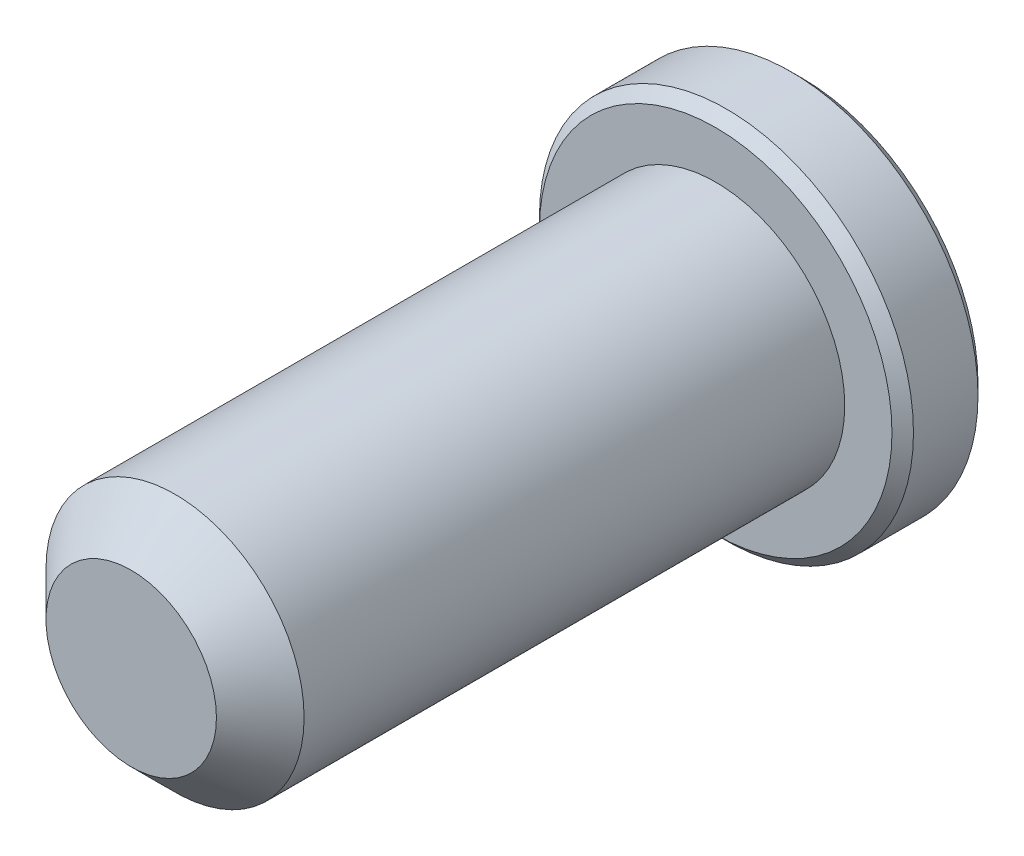
ISO-10303-21;
HEADER;
FILE_DESCRIPTION(('STEP AP214'),'2;1');
FILE_NAME('part.step','',(''),(''),'','','');
FILE_SCHEMA(('AUTOMOTIVE_DESIGN { 1 0 10303 214 1 1 1 1 }'));
ENDSEC;
DATA;
#1=APPLICATION_CONTEXT('core data for automotive mechanical design processes');
#2=APPLICATION_PROTOCOL_DEFINITION('international standard','automotive_design',2000,#1);
#3=PRODUCT_CONTEXT('',#1,'mechanical');
#4=PRODUCT('Part','Part','',(#3));
#5=PRODUCT_RELATED_PRODUCT_CATEGORY('part','',(#4));
#6=PRODUCT_DEFINITION_FORMATION('','',#4);
#7=PRODUCT_DEFINITION_CONTEXT('part definition',#1,'design');
#8=PRODUCT_DEFINITION('design','',#6,#7);
#9=PRODUCT_DEFINITION_SHAPE('','',#8);
#10=(LENGTH_UNIT() NAMED_UNIT(*) SI_UNIT(.MILLI.,.METRE.));
#11=(NAMED_UNIT(*) PLANE_ANGLE_UNIT() SI_UNIT($,.RADIAN.));
#12=(NAMED_UNIT(*) SI_UNIT($,.STERADIAN.) SOLID_ANGLE_UNIT());
#13=UNCERTAINTY_MEASURE_WITH_UNIT(LENGTH_MEASURE(1.E-05),#10,'distance_accuracy_value','');
#14=(GEOMETRIC_REPRESENTATION_CONTEXT(3) GLOBAL_UNCERTAINTY_ASSIGNED_CONTEXT((#13)) GLOBAL_UNIT_ASSIGNED_CONTEXT((#10,
#11,#12)) REPRESENTATION_CONTEXT('',''));
#15=CARTESIAN_POINT('',(0.,0.,0.));
#16=DIRECTION('',(0.,0.,1.));
#17=DIRECTION('',(1.,0.,0.));
#18=AXIS2_PLACEMENT_3D('',#15,#16,#17);
#19=CARTESIAN_POINT('',(0.,0.,-4.55295));
#20=DIRECTION('',(0.,0.,1.));
#21=DIRECTION('',(1.,0.,0.));
#22=AXIS2_PLACEMENT_3D('',#19,#20,#21);
#23=PLANE('',#22);
#24=CARTESIAN_POINT('',(0.,0.,-4.55295));
#25=DIRECTION('',(0.,0.,1.));
#26=DIRECTION('',(1.,0.,0.));
#27=AXIS2_PLACEMENT_3D('',#24,#25,#26);
#28=CIRCLE('',#27,2.39395);
#29=CARTESIAN_POINT('',(2.39395,0.,-4.55295));
#30=VERTEX_POINT('',#29);
#31=EDGE_CURVE('E146',#30,#30,#28,.F.);
#32=ORIENTED_EDGE('',*,*,#31,.T.);
#33=EDGE_LOOP('',(#32));
#34=FACE_BOUND('',#33,.T.);
#35=CARTESIAN_POINT('',(0.,0.,-4.55295));
#36=DIRECTION('',(0.,0.,1.));
#37=DIRECTION('',(1.,0.,0.));
#38=AXIS2_PLACEMENT_3D('',#35,#36,#37);
#39=CIRCLE('',#38,0.916543552338527);
#40=CARTESIAN_POINT('',(0.793749999999995,0.458271776169268,-4.55295));
#41=VERTEX_POINT('',#40);
#42=CARTESIAN_POINT('',(0.,0.916543552338527,-4.55295));
#43=VERTEX_POINT('',#42);
#44=EDGE_CURVE('E95',#41,#43,#39,.T.);
#45=ORIENTED_EDGE('',*,*,#44,.T.);
#46=CARTESIAN_POINT('',(0.,0.,-4.55295));
#47=DIRECTION('',(0.,0.,1.));
#48=DIRECTION('',(1.,0.,0.));
#49=AXIS2_PLACEMENT_3D('',#46,#47,#48);
#50=CIRCLE('',#49,0.916543552338527);
#51=CARTESIAN_POINT('',(-0.793749999999997,0.458271776169263,-4.55295));
#52=VERTEX_POINT('',#51);
#53=EDGE_CURVE('E106',#43,#52,#50,.T.);
#54=ORIENTED_EDGE('',*,*,#53,.T.);
#55=CARTESIAN_POINT('',(0.,0.,-4.55295));
#56=DIRECTION('',(0.,0.,1.));
#57=DIRECTION('',(1.,0.,0.));
#58=AXIS2_PLACEMENT_3D('',#55,#56,#57);
#59=CIRCLE('',#58,0.916543552338527);
#60=CARTESIAN_POINT('',(-0.793749999999998,-0.458271776169261,-4.55295));
#61=VERTEX_POINT('',#60);
#62=EDGE_CURVE('E124',#52,#61,#59,.T.);
#63=ORIENTED_EDGE('',*,*,#62,.T.);
#64=CARTESIAN_POINT('',(0.,0.,-4.55295));
#65=DIRECTION('',(0.,0.,1.));
#66=DIRECTION('',(1.,0.,0.));
#67=AXIS2_PLACEMENT_3D('',#64,#65,#66);
#68=CIRCLE('',#67,0.916543552338527);
#69=CARTESIAN_POINT('',(0.,-0.916543552338527,-4.55295));
#70=VERTEX_POINT('',#69);
#71=EDGE_CURVE('E390',#61,#70,#68,.T.);
#72=ORIENTED_EDGE('',*,*,#71,.T.);
#73=CARTESIAN_POINT('',(0.,0.,-4.55295));
#74=DIRECTION('',(0.,0.,1.));
#75=DIRECTION('',(1.,0.,0.));
#76=AXIS2_PLACEMENT_3D('',#73,#74,#75);
#77=CIRCLE('',#76,0.916543552338527);
#78=CARTESIAN_POINT('',(0.793749999999995,-0.458271776169268,-4.55295));
#79=VERTEX_POINT('',#78);
#80=EDGE_CURVE('E391',#70,#79,#77,.T.);
#81=ORIENTED_EDGE('',*,*,#80,.T.);
#82=CARTESIAN_POINT('',(0.,0.,-4.55295));
#83=DIRECTION('',(0.,0.,1.));
#84=DIRECTION('',(1.,0.,0.));
#85=AXIS2_PLACEMENT_3D('',#82,#83,#84);
#86=CIRCLE('',#85,0.916543552338527);
#87=EDGE_CURVE('E109',#79,#41,#86,.T.);
#88=ORIENTED_EDGE('',*,*,#87,.T.);
#89=EDGE_LOOP('',(#45,#54,#63,#72,#81,#88));
#90=FACE_BOUND('',#89,.T.);
#91=ADVANCED_FACE('F37',(#34,#90),#23,.F.);
#92=CARTESIAN_POINT('',(0.793749999999995,0.458271776169266,-3.67665));
#93=DIRECTION('',(-0.5,-0.866025403784439,0.));
#94=DIRECTION('',(0.866025403784439,-0.5,0.));
#95=AXIS2_PLACEMENT_3D('',#92,#93,#94);
#96=PLANE('',#95);
#97=DIRECTION('',(0.,0.,-1.));
#98=VECTOR('',#97,1.);
#99=CARTESIAN_POINT('',(0.,0.916543552338527,-3.67665));
#100=LINE('',#99,#98);
#101=CARTESIAN_POINT('',(0.,0.916543552338527,-3.67665));
#102=VERTEX_POINT('',#101);
#103=EDGE_CURVE('E121',#102,#43,#100,.T.);
#104=ORIENTED_EDGE('',*,*,#103,.T.);
#105=CARTESIAN_POINT('',(0.793949999999994,0.458156306115428,-4.5530654918722));
#106=CARTESIAN_POINT('',(0.766656326829095,0.473914315667821,-4.53731677881995));
#107=CARTESIAN_POINT('',(0.738906237701704,0.489935837095556,-4.52249254758417));
#108=CARTESIAN_POINT('',(0.682320250463156,0.522605772060092,-4.49534903778593));
#109=CARTESIAN_POINT('',(0.653478963353308,0.539257296936738,-4.48304487372838));
#110=CARTESIAN_POINT('',(0.595321679020442,0.572834420701656,-4.46196736657059));
#111=CARTESIAN_POINT('',(0.566020514797217,0.589751455753504,-4.45314100814755));
#112=CARTESIAN_POINT('',(0.506773157113021,0.623957933661249,-4.43954123872424));
#113=CARTESIAN_POINT('',(0.47682877563836,0.641246330366361,-4.43475766812998));
#114=CARTESIAN_POINT('',(0.425225377533546,0.671039566153275,-4.43044340945594));
#115=CARTESIAN_POINT('',(0.403633531741487,0.683505624133621,-4.42980527141097));
#116=CARTESIAN_POINT('',(0.360491632722967,0.708413611145315,-4.43087613979119));
#117=CARTESIAN_POINT('',(0.338941589763514,0.720855534249004,-4.43258566388179));
#118=CARTESIAN_POINT('',(0.274599154455216,0.758003656594565,-4.44112279115859));
#119=CARTESIAN_POINT('',(0.232126946019304,0.782524997568117,-4.45135991913679));
#120=CARTESIAN_POINT('',(0.157575609219718,0.825567231937804,-4.47606858984055));
#121=CARTESIAN_POINT('',(0.125147212182333,0.844289775696727,-4.48924617467531));
#122=CARTESIAN_POINT('',(0.0615608535385168,0.881001376976522,-4.51893103995168));
#123=CARTESIAN_POINT('',(0.0303991453684835,0.898992597576899,-4.53542748789317));
#124=CARTESIAN_POINT('',(-0.000199999999999388,0.916659022392365,-4.5530654918722));
#125=B_SPLINE_CURVE_WITH_KNOTS('',3,(#105,#106,#107,#108,#109,#110,#111,#112,#113,#114,#115,
#116,#117,#118,#119,#120,#121,#122,#123,#124),.UNSPECIFIED.,.F.,.F.,(4,2,2,2,2,2,2,2,2,4),(0.,
0.10576869910562,0.212154297186217,0.316848842533855,0.421279499712341,0.495991864977068,
0.570720707151278,0.720221070373878,0.839150369964794,0.957697614118383),.UNSPECIFIED.);
#126=EDGE_CURVE('E92',#41,#43,#125,.T.);
#127=ORIENTED_EDGE('',*,*,#126,.F.);
#128=DIRECTION('',(0.,0.,-1.));
#129=VECTOR('',#128,1.);
#130=CARTESIAN_POINT('',(0.793749999999995,0.458271776169266,-3.67665));
#131=LINE('',#130,#129);
#132=CARTESIAN_POINT('',(0.793749999999995,0.458271776169266,-3.67665));
#133=VERTEX_POINT('',#132);
#134=EDGE_CURVE('E373',#133,#41,#131,.T.);
#135=ORIENTED_EDGE('',*,*,#134,.F.);
#136=DIRECTION('',(-0.866025403784439,0.499999999999999,0.));
#137=VECTOR('',#136,1.);
#138=CARTESIAN_POINT('',(0.793749999999995,0.458271776169266,-3.67665));
#139=LINE('',#138,#137);
#140=EDGE_CURVE('E116',#133,#102,#139,.T.);
#141=ORIENTED_EDGE('',*,*,#140,.T.);
#142=EDGE_LOOP('',(#104,#127,#135,#141));
#143=FACE_BOUND('',#142,.T.);
#144=ADVANCED_FACE('F127',(#143),#96,.T.);
#145=CARTESIAN_POINT('',(0.793749999999995,-0.458271776169262,-3.67665));
#146=DIRECTION('',(-1.,0.,0.));
#147=DIRECTION('',(0.,0.,1.));
#148=AXIS2_PLACEMENT_3D('',#145,#146,#147);
#149=PLANE('',#148);
#150=ORIENTED_EDGE('',*,*,#134,.T.);
#151=CARTESIAN_POINT('',(0.793749999999995,-0.917946850190807,-4.84994074148065));
#152=CARTESIAN_POINT('',(0.793749999999995,-0.895613228828848,-4.83304961462345));
#153=CARTESIAN_POINT('',(0.793749999999995,-0.873155597287342,-4.81632292298384));
#154=CARTESIAN_POINT('',(0.793749999999995,-0.827941857041957,-4.78326645454722));
#155=CARTESIAN_POINT('',(0.793749999999995,-0.805185675742226,-4.76693677715004));
#156=CARTESIAN_POINT('',(0.793749999999995,-0.736060408594208,-4.71841225476943));
#157=CARTESIAN_POINT('',(0.793749999999995,-0.689174107720679,-4.686942019392));
#158=CARTESIAN_POINT('',(0.793749999999995,-0.590829704933217,-4.62512579830388));
#159=CARTESIAN_POINT('',(0.793749999999995,-0.539263874564416,-4.59494926431388));
#160=CARTESIAN_POINT('',(0.793749999999995,-0.43355155724491,-4.53972454875376));
#161=CARTESIAN_POINT('',(0.793749999999995,-0.37941456352554,-4.5146590734229));
#162=CARTESIAN_POINT('',(0.793749999999995,-0.29819241810067,-4.48399259599826));
#163=CARTESIAN_POINT('',(0.793749999999995,-0.272318174502547,-4.47519776584136));
#164=CARTESIAN_POINT('',(0.793749999999995,-0.219941564885055,-4.45968489350758));
#165=CARTESIAN_POINT('',(0.793749999999995,-0.193439156061048,-4.45296699329812));
#166=CARTESIAN_POINT('',(0.793749999999995,-0.140413570054122,-4.44207080319624));
#167=CARTESIAN_POINT('',(0.793749999999995,-0.113899603282987,-4.43784839260937));
#168=CARTESIAN_POINT('',(0.793749999999995,-0.0605750976673011,-4.43202357219952));
#169=CARTESIAN_POINT('',(0.793749999999995,-0.0337645152092859,-4.43042155296719));
#170=CARTESIAN_POINT('',(0.793749999999995,0.018885611792515,-4.42996076205706));
#171=CARTESIAN_POINT('',(0.793749999999995,0.0447243186595915,-4.43100252198509));
#172=CARTESIAN_POINT('',(0.793749999999995,0.0961846769869617,-4.43555175601619));
#173=CARTESIAN_POINT('',(0.793749999999995,0.121806286153858,-4.43905969987224));
#174=CARTESIAN_POINT('',(0.793749999999995,0.173077073819698,-4.44840864732177));
#175=CARTESIAN_POINT('',(0.793749999999995,0.198718895644858,-4.45428938612484));
#176=CARTESIAN_POINT('',(0.793749999999995,0.249441767169892,-4.4680701830696));
#177=CARTESIAN_POINT('',(0.793749999999995,0.274522862236941,-4.47597007719818));
#178=CARTESIAN_POINT('',(0.793749999999995,0.353307525190685,-4.50376188372902));
#179=CARTESIAN_POINT('',(0.793749999999995,0.405894424132555,-4.52681146683416));
#180=CARTESIAN_POINT('',(0.793749999999995,0.508599423391911,-4.5780645237788));
#181=CARTESIAN_POINT('',(0.793749999999995,0.558707826152093,-4.60628647751454));
#182=CARTESIAN_POINT('',(0.793749999999995,0.654474819417663,-4.66451640371694));
#183=CARTESIAN_POINT('',(0.793749999999995,0.7002308225863,-4.69436615453288));
#184=CARTESIAN_POINT('',(0.793749999999995,0.76764300552328,-4.74051315797963));
#185=CARTESIAN_POINT('',(0.793749999999995,0.789822886293958,-4.75605866570407));
#186=CARTESIAN_POINT('',(0.793749999999995,0.833879431809418,-4.78756145763103));
#187=CARTESIAN_POINT('',(0.793749999999995,0.855756177842151,-4.80351862802463));
#188=CARTESIAN_POINT('',(0.793749999999995,0.877506681225812,-4.81964650703063));
#189=B_SPLINE_CURVE_WITH_KNOTS('',3,(#151,#152,#153,#154,#155,#156,#157,#158,#159,#160,#161,
#162,#163,#164,#165,#166,#167,#168,#169,#170,#171,#172,#173,#174,#175,#176,#177,#178,#179,#180,
#181,#182,#183,#184,#185,#186,#187,#188),.UNSPECIFIED.,.F.,.F.,(4,2,2,2,2,2,2,2,2,2,2,2,2,2,2,2,
2,2,4),(0.,0.0840032774866331,0.168027374557445,0.337357863130994,0.516451917795755,
0.694929549501232,0.776844639001339,0.858765326525317,0.939190594211611,1.01962784884614,
1.09708397859408,1.17455486600445,1.253380827017,1.33220038714257,1.50394514534536,
1.67631592014455,1.84012941585922,1.92138200254265,2.00261236176623),.UNSPECIFIED.);
#190=EDGE_CURVE('E99',#79,#41,#189,.T.);
#191=ORIENTED_EDGE('',*,*,#190,.F.);
#192=DIRECTION('',(0.,0.,-1.));
#193=VECTOR('',#192,1.);
#194=CARTESIAN_POINT('',(0.793749999999995,-0.458271776169262,-3.67665));
#195=LINE('',#194,#193);
#196=CARTESIAN_POINT('',(0.793749999999995,-0.458271776169262,-3.67665));
#197=VERTEX_POINT('',#196);
#198=EDGE_CURVE('E375',#197,#79,#195,.T.);
#199=ORIENTED_EDGE('',*,*,#198,.F.);
#200=DIRECTION('',(0.,1.,0.));
#201=VECTOR('',#200,1.);
#202=CARTESIAN_POINT('',(0.793749999999995,-0.458271776169262,-3.67665));
#203=LINE('',#202,#201);
#204=EDGE_CURVE('E52',#197,#133,#203,.T.);
#205=ORIENTED_EDGE('',*,*,#204,.T.);
#206=EDGE_LOOP('',(#150,#191,#199,#205));
#207=FACE_BOUND('',#206,.T.);
#208=ADVANCED_FACE('F168',(#207),#149,.T.);
#209=CARTESIAN_POINT('',(0.,-0.916543552338525,-3.67665));
#210=DIRECTION('',(-0.500000000000001,0.866025403784438,0.));
#211=DIRECTION('',(-0.866025403784438,-0.500000000000001,0.));
#212=AXIS2_PLACEMENT_3D('',#209,#210,#211);
#213=PLANE('',#212);
#214=ORIENTED_EDGE('',*,*,#198,.T.);
#215=CARTESIAN_POINT('',(-0.000199999999999979,-0.916659022392363,-4.5530654918722));
#216=CARTESIAN_POINT('',(0.0270936731708998,-0.90090101283997,-4.53731677881995));
#217=CARTESIAN_POINT('',(0.0548437622982909,-0.884879491412235,-4.52249254758417));
#218=CARTESIAN_POINT('',(0.111429749536839,-0.852209556447698,-4.49534903778593));
#219=CARTESIAN_POINT('',(0.140271036646687,-0.835558031571052,-4.48304487372837));
#220=CARTESIAN_POINT('',(0.198428320979553,-0.801980907806134,-4.46196736657059));
#221=CARTESIAN_POINT('',(0.227729485202778,-0.785063872754286,-4.45314100814754));
#222=CARTESIAN_POINT('',(0.286976842886974,-0.750857394846541,-4.43954123872423));
#223=CARTESIAN_POINT('',(0.316921224361635,-0.733568998141429,-4.43475766812998));
#224=CARTESIAN_POINT('',(0.36852462246645,-0.703775762354515,-4.43044340945594));
#225=CARTESIAN_POINT('',(0.390116468258509,-0.691309704374169,-4.42980527141096));
#226=CARTESIAN_POINT('',(0.433258367277029,-0.666401717362474,-4.43087613979119));
#227=CARTESIAN_POINT('',(0.454808410236482,-0.653959794258786,-4.43258566388178));
#228=CARTESIAN_POINT('',(0.51915084554478,-0.616811671913225,-4.44112279115859));
#229=CARTESIAN_POINT('',(0.561623053980691,-0.592290330939673,-4.45135991913679));
#230=CARTESIAN_POINT('',(0.636174390780277,-0.549248096569985,-4.47606858984054));
#231=CARTESIAN_POINT('',(0.668602787817663,-0.530525552811063,-4.4892461746753));
#232=CARTESIAN_POINT('',(0.732189146461478,-0.493813951531267,-4.51893103995167));
#233=CARTESIAN_POINT('',(0.763350854631512,-0.47582273093089,-4.53542748789316));
#234=CARTESIAN_POINT('',(0.793949999999994,-0.458156306115424,-4.5530654918722));
#235=B_SPLINE_CURVE_WITH_KNOTS('',3,(#215,#216,#217,#218,#219,#220,#221,#222,#223,#224,#225,
#226,#227,#228,#229,#230,#231,#232,#233,#234),.UNSPECIFIED.,.F.,.F.,(4,2,2,2,2,2,2,2,2,4),(0.,
0.105768699105621,0.212154297186218,0.316848842533857,0.421279499712343,0.49599186497707,
0.57072070715128,0.720221070373879,0.839150369964796,0.957697614118385),.UNSPECIFIED.);
#236=EDGE_CURVE('E413',#70,#79,#235,.T.);
#237=ORIENTED_EDGE('',*,*,#236,.F.);
#238=DIRECTION('',(0.,0.,-1.));
#239=VECTOR('',#238,1.);
#240=CARTESIAN_POINT('',(0.,-0.916543552338525,-3.67665));
#241=LINE('',#240,#239);
#242=CARTESIAN_POINT('',(0.,-0.916543552338525,-3.67665));
#243=VERTEX_POINT('',#242);
#244=EDGE_CURVE('E377',#243,#70,#241,.T.);
#245=ORIENTED_EDGE('',*,*,#244,.F.);
#246=DIRECTION('',(0.866025403784438,0.500000000000001,0.));
#247=VECTOR('',#246,1.);
#248=CARTESIAN_POINT('',(0.,-0.916543552338525,-3.67665));
#249=LINE('',#248,#247);
#250=EDGE_CURVE('E60',#243,#197,#249,.T.);
#251=ORIENTED_EDGE('',*,*,#250,.T.);
#252=EDGE_LOOP('',(#214,#237,#245,#251));
#253=FACE_BOUND('',#252,.T.);
#254=ADVANCED_FACE('F286',(#253),#213,.T.);
#255=CARTESIAN_POINT('',(-0.793749999999997,-0.458271776169262,-3.67665));
#256=DIRECTION('',(0.5,0.866025403784439,0.));
#257=DIRECTION('',(-0.866025403784439,0.5,0.));
#258=AXIS2_PLACEMENT_3D('',#255,#256,#257);
#259=PLANE('',#258);
#260=ORIENTED_EDGE('',*,*,#244,.T.);
#261=CARTESIAN_POINT('',(-0.793949999999997,-0.458156306115424,-4.5530654918722));
#262=CARTESIAN_POINT('',(-0.766656326829097,-0.473914315667817,-4.53731677881995));
#263=CARTESIAN_POINT('',(-0.738906237701706,-0.489935837095552,-4.52249254758417));
#264=CARTESIAN_POINT('',(-0.682320250463157,-0.522605772060089,-4.49534903778593));
#265=CARTESIAN_POINT('',(-0.653478963353309,-0.539257296936735,-4.48304487372837));
#266=CARTESIAN_POINT('',(-0.595321679020442,-0.572834420701653,-4.46196736657059));
#267=CARTESIAN_POINT('',(-0.566020514797217,-0.589751455753502,-4.45314100814754));
#268=CARTESIAN_POINT('',(-0.506773157113021,-0.623957933661246,-4.43954123872423));
#269=CARTESIAN_POINT('',(-0.47682877563836,-0.641246330366359,-4.43475766812998));
#270=CARTESIAN_POINT('',(-0.425225377533545,-0.671039566153273,-4.43044340945594));
#271=CARTESIAN_POINT('',(-0.403633531741486,-0.683505624133619,-4.42980527141096));
#272=CARTESIAN_POINT('',(-0.360491632722966,-0.708413611145313,-4.43087613979119));
#273=CARTESIAN_POINT('',(-0.338941589763513,-0.720855534249001,-4.43258566388179));
#274=CARTESIAN_POINT('',(-0.274599154455215,-0.758003656594563,-4.44112279115859));
#275=CARTESIAN_POINT('',(-0.232126946019303,-0.782524997568115,-4.45135991913679));
#276=CARTESIAN_POINT('',(-0.157575609219717,-0.825567231937802,-4.47606858984054));
#277=CARTESIAN_POINT('',(-0.125147212182332,-0.844289775696725,-4.48924617467531));
#278=CARTESIAN_POINT('',(-0.0615608535385157,-0.88100137697652,-4.51893103995167));
#279=CARTESIAN_POINT('',(-0.0303991453684824,-0.898992597576897,-4.53542748789316));
#280=CARTESIAN_POINT('',(0.000200000000000205,-0.916659022392363,-4.5530654918722));
#281=B_SPLINE_CURVE_WITH_KNOTS('',3,(#261,#262,#263,#264,#265,#266,#267,#268,#269,#270,#271,
#272,#273,#274,#275,#276,#277,#278,#279,#280),.UNSPECIFIED.,.F.,.F.,(4,2,2,2,2,2,2,2,2,4),(0.,
0.105768699105621,0.21215429718622,0.316848842533858,0.421279499712345,0.495991864977073,
0.570720707151282,0.720221070373882,0.839150369964798,0.957697614118387),.UNSPECIFIED.);
#282=EDGE_CURVE('E388',#61,#70,#281,.T.);
#283=ORIENTED_EDGE('',*,*,#282,.F.);
#284=DIRECTION('',(0.,0.,-1.));
#285=VECTOR('',#284,1.);
#286=CARTESIAN_POINT('',(-0.793749999999997,-0.458271776169262,-3.67665));
#287=LINE('',#286,#285);
#288=CARTESIAN_POINT('',(-0.793749999999997,-0.458271776169262,-3.67665));
#289=VERTEX_POINT('',#288);
#290=EDGE_CURVE('E134',#289,#61,#287,.T.);
#291=ORIENTED_EDGE('',*,*,#290,.F.);
#292=DIRECTION('',(0.866025403784439,-0.5,0.));
#293=VECTOR('',#292,1.);
#294=CARTESIAN_POINT('',(-0.793749999999997,-0.458271776169262,-3.67665));
#295=LINE('',#294,#293);
#296=EDGE_CURVE('E369',#289,#243,#295,.T.);
#297=ORIENTED_EDGE('',*,*,#296,.T.);
#298=EDGE_LOOP('',(#260,#283,#291,#297));
#299=FACE_BOUND('',#298,.T.);
#300=ADVANCED_FACE('F294',(#299),#259,.T.);
#301=CARTESIAN_POINT('',(-0.793749999999997,0.458271776169263,-3.67665));
#302=DIRECTION('',(1.,0.,0.));
#303=DIRECTION('',(0.,1.,0.));
#304=AXIS2_PLACEMENT_3D('',#301,#302,#303);
#305=PLANE('',#304);
#306=ORIENTED_EDGE('',*,*,#290,.T.);
#307=CARTESIAN_POINT('',(-0.793749999999996,-0.917946850190807,-4.84994074148065));
#308=CARTESIAN_POINT('',(-0.793749999999996,-0.895613228828849,-4.83304961462345));
#309=CARTESIAN_POINT('',(-0.793749999999996,-0.873155597287342,-4.81632292298385));
#310=CARTESIAN_POINT('',(-0.793749999999996,-0.827941857041957,-4.78326645454723));
#311=CARTESIAN_POINT('',(-0.793749999999997,-0.805185675742227,-4.76693677715004));
#312=CARTESIAN_POINT('',(-0.793749999999997,-0.736060408594208,-4.71841225476943));
#313=CARTESIAN_POINT('',(-0.793749999999997,-0.68917410772068,-4.686942019392));
#314=CARTESIAN_POINT('',(-0.793749999999997,-0.590829704933217,-4.62512579830389));
#315=CARTESIAN_POINT('',(-0.793749999999997,-0.539263874564415,-4.59494926431388));
#316=CARTESIAN_POINT('',(-0.793749999999997,-0.433551557244909,-4.53972454875377));
#317=CARTESIAN_POINT('',(-0.793749999999997,-0.37941456352554,-4.5146590734229));
#318=CARTESIAN_POINT('',(-0.793749999999997,-0.29819241810067,-4.48399259599826));
#319=CARTESIAN_POINT('',(-0.793749999999997,-0.272318174502547,-4.47519776584136));
#320=CARTESIAN_POINT('',(-0.793749999999997,-0.219941564885055,-4.45968489350758));
#321=CARTESIAN_POINT('',(-0.793749999999997,-0.193439156061048,-4.45296699329812));
#322=CARTESIAN_POINT('',(-0.793749999999997,-0.140413570054122,-4.44207080319624));
#323=CARTESIAN_POINT('',(-0.793749999999997,-0.113899603282987,-4.43784839260937));
#324=CARTESIAN_POINT('',(-0.793749999999997,-0.0605750976673012,-4.43202357219953));
#325=CARTESIAN_POINT('',(-0.793749999999997,-0.033764515209286,-4.43042155296719));
#326=CARTESIAN_POINT('',(-0.793749999999997,0.018885611792515,-4.42996076205706));
#327=CARTESIAN_POINT('',(-0.793749999999997,0.0447243186595915,-4.43100252198509));
#328=CARTESIAN_POINT('',(-0.793749999999997,0.0961846769869619,-4.43555175601619));
#329=CARTESIAN_POINT('',(-0.793749999999997,0.121806286153859,-4.43905969987224));
#330=CARTESIAN_POINT('',(-0.793749999999997,0.173077073819698,-4.44840864732178));
#331=CARTESIAN_POINT('',(-0.793749999999997,0.198718895644859,-4.45428938612484));
#332=CARTESIAN_POINT('',(-0.793749999999997,0.249441767169893,-4.4680701830696));
#333=CARTESIAN_POINT('',(-0.793749999999997,0.274522862236941,-4.47597007719819));
#334=CARTESIAN_POINT('',(-0.793749999999997,0.353307525190686,-4.50376188372902));
#335=CARTESIAN_POINT('',(-0.793749999999997,0.405894424132556,-4.52681146683416));
#336=CARTESIAN_POINT('',(-0.793749999999997,0.508599423391913,-4.5780645237788));
#337=CARTESIAN_POINT('',(-0.793749999999998,0.558707826152094,-4.60628647751455));
#338=CARTESIAN_POINT('',(-0.793749999999998,0.654474819417664,-4.66451640371695));
#339=CARTESIAN_POINT('',(-0.793749999999998,0.700230822586302,-4.69436615453289));
#340=CARTESIAN_POINT('',(-0.793749999999998,0.767643005523282,-4.74051315797963));
#341=CARTESIAN_POINT('',(-0.793749999999998,0.78982288629396,-4.75605866570407));
#342=CARTESIAN_POINT('',(-0.793749999999998,0.83387943180942,-4.78756145763104));
#343=CARTESIAN_POINT('',(-0.793749999999998,0.855756177842153,-4.80351862802463));
#344=CARTESIAN_POINT('',(-0.793749999999998,0.877506681225814,-4.81964650703063));
#345=B_SPLINE_CURVE_WITH_KNOTS('',3,(#307,#308,#309,#310,#311,#312,#313,#314,#315,#316,#317,
#318,#319,#320,#321,#322,#323,#324,#325,#326,#327,#328,#329,#330,#331,#332,#333,#334,#335,#336,
#337,#338,#339,#340,#341,#342,#343,#344),.UNSPECIFIED.,.F.,.F.,(4,2,2,2,2,2,2,2,2,2,2,2,2,2,2,2,
2,2,4),(0.,0.084003277486633,0.168027374557444,0.337357863130994,0.516451917795756,
0.694929549501232,0.776844639001339,0.858765326525317,0.939190594211611,1.01962784884614,
1.09708397859408,1.17455486600445,1.253380827017,1.33220038714257,1.50394514534536,
1.67631592014456,1.84012941585922,1.92138200254265,2.00261236176623),.UNSPECIFIED.);
#346=EDGE_CURVE('E383',#52,#61,#345,.F.);
#347=ORIENTED_EDGE('',*,*,#346,.F.);
#348=DIRECTION('',(0.,0.,-1.));
#349=VECTOR('',#348,1.);
#350=CARTESIAN_POINT('',(-0.793749999999997,0.458271776169263,-3.67665));
#351=LINE('',#350,#349);
#352=CARTESIAN_POINT('',(-0.793749999999997,0.458271776169263,-3.67665));
#353=VERTEX_POINT('',#352);
#354=EDGE_CURVE('E123',#353,#52,#351,.T.);
#355=ORIENTED_EDGE('',*,*,#354,.F.);
#356=DIRECTION('',(0.,-1.,0.));
#357=VECTOR('',#356,1.);
#358=CARTESIAN_POINT('',(-0.793749999999997,0.458271776169263,-3.67665));
#359=LINE('',#358,#357);
#360=EDGE_CURVE('E367',#353,#289,#359,.T.);
#361=ORIENTED_EDGE('',*,*,#360,.T.);
#362=EDGE_LOOP('',(#306,#347,#355,#361));
#363=FACE_BOUND('',#362,.T.);
#364=ADVANCED_FACE('F302',(#363),#305,.T.);
#365=CARTESIAN_POINT('',(0.,0.916543552338527,-3.67665));
#366=DIRECTION('',(0.5,-0.866025403784439,0.));
#367=DIRECTION('',(0.866025403784439,0.5,0.));
#368=AXIS2_PLACEMENT_3D('',#365,#366,#367);
#369=PLANE('',#368);
#370=ORIENTED_EDGE('',*,*,#354,.T.);
#371=CARTESIAN_POINT('',(0.000200000000000282,0.916659022392365,-4.5530654918722));
#372=CARTESIAN_POINT('',(-0.0270936731708993,0.900901012839972,-4.53731677881995));
#373=CARTESIAN_POINT('',(-0.0548437622982906,0.884879491412237,-4.52249254758417));
#374=CARTESIAN_POINT('',(-0.111429749536839,0.8522095564477,-4.49534903778593));
#375=CARTESIAN_POINT('',(-0.140271036646687,0.835558031571054,-4.48304487372838));
#376=CARTESIAN_POINT('',(-0.198428320979554,0.801980907806136,-4.46196736657059));
#377=CARTESIAN_POINT('',(-0.227729485202778,0.785063872754288,-4.45314100814754));
#378=CARTESIAN_POINT('',(-0.286976842886975,0.750857394846543,-4.43954123872424));
#379=CARTESIAN_POINT('',(-0.316921224361635,0.733568998141431,-4.43475766812998));
#380=CARTESIAN_POINT('',(-0.36852462246645,0.703775762354517,-4.43044340945594));
#381=CARTESIAN_POINT('',(-0.390116468258509,0.691309704374171,-4.42980527141096));
#382=CARTESIAN_POINT('',(-0.433258367277029,0.666401717362477,-4.43087613979119));
#383=CARTESIAN_POINT('',(-0.454808410236482,0.653959794258788,-4.43258566388179));
#384=CARTESIAN_POINT('',(-0.51915084554478,0.616811671913227,-4.44112279115859));
#385=CARTESIAN_POINT('',(-0.561623053980692,0.592290330939675,-4.45135991913679));
#386=CARTESIAN_POINT('',(-0.636174390780278,0.549248096569987,-4.47606858984055));
#387=CARTESIAN_POINT('',(-0.668602787817664,0.530525552811064,-4.48924617467531));
#388=CARTESIAN_POINT('',(-0.732189146461481,0.493813951531269,-4.51893103995168));
#389=CARTESIAN_POINT('',(-0.763350854631514,0.475822730930891,-4.53542748789316));
#390=CARTESIAN_POINT('',(-0.793949999999997,0.458156306115425,-4.5530654918722));
#391=B_SPLINE_CURVE_WITH_KNOTS('',3,(#371,#372,#373,#374,#375,#376,#377,#378,#379,#380,#381,
#382,#383,#384,#385,#386,#387,#388,#389,#390),.UNSPECIFIED.,.F.,.F.,(4,2,2,2,2,2,2,2,2,4),(0.,
0.105768699105621,0.212154297186218,0.316848842533857,0.421279499712343,0.495991864977071,
0.57072070715128,0.72022107037388,0.839150369964798,0.957697614118388),.UNSPECIFIED.);
#392=EDGE_CURVE('E115',#43,#52,#391,.T.);
#393=ORIENTED_EDGE('',*,*,#392,.F.);
#394=ORIENTED_EDGE('',*,*,#103,.F.);
#395=DIRECTION('',(-0.866025403784439,-0.5,0.));
#396=VECTOR('',#395,1.);
#397=CARTESIAN_POINT('',(0.,0.916543552338527,-3.67665));
#398=LINE('',#397,#396);
#399=EDGE_CURVE('E365',#102,#353,#398,.T.);
#400=ORIENTED_EDGE('',*,*,#399,.T.);
#401=EDGE_LOOP('',(#370,#393,#394,#400));
#402=FACE_BOUND('',#401,.T.);
#403=ADVANCED_FACE('F120',(#402),#369,.T.);
#404=CARTESIAN_POINT('',(0.,0.,4.55295));
#405=DIRECTION('',(0.,0.,-1.));
#406=DIRECTION('',(-1.,0.,0.));
#407=AXIS2_PLACEMENT_3D('',#404,#405,#406);
#408=CYLINDRICAL_SURFACE('',#407,1.7526);
#409=CARTESIAN_POINT('',(0.,0.,3.9576375));
#410=DIRECTION('',(0.,0.,1.));
#411=DIRECTION('',(1.,0.,0.));
#412=AXIS2_PLACEMENT_3D('',#409,#410,#411);
#413=CIRCLE('',#412,1.7526);
#414=CARTESIAN_POINT('',(1.7526,0.,3.9576375));
#415=VERTEX_POINT('',#414);
#416=EDGE_CURVE('E11',#415,#415,#413,.F.);
#417=ORIENTED_EDGE('',*,*,#416,.T.);
#418=EDGE_LOOP('',(#417));
#419=FACE_BOUND('',#418,.T.);
#420=CARTESIAN_POINT('',(0.,0.,-3.38455));
#421=DIRECTION('',(0.,0.,1.));
#422=DIRECTION('',(1.,0.,0.));
#423=AXIS2_PLACEMENT_3D('',#420,#421,#422);
#424=CIRCLE('',#423,1.7526);
#425=CARTESIAN_POINT('',(1.7526,0.,-3.38455));
#426=VERTEX_POINT('',#425);
#427=EDGE_CURVE('E129',#426,#426,#424,.T.);
#428=ORIENTED_EDGE('',*,*,#427,.T.);
#429=EDGE_LOOP('',(#428));
#430=FACE_BOUND('',#429,.T.);
#431=ADVANCED_FACE('F180',(#419,#430),#408,.T.);
#432=CARTESIAN_POINT('',(0.,0.,4.55295));
#433=DIRECTION('',(0.,0.,1.));
#434=DIRECTION('',(1.,0.,0.));
#435=AXIS2_PLACEMENT_3D('',#432,#433,#434);
#436=PLANE('',#435);
#437=CARTESIAN_POINT('',(0.,0.,4.55295));
#438=DIRECTION('',(0.,0.,1.));
#439=DIRECTION('',(1.,0.,0.));
#440=AXIS2_PLACEMENT_3D('',#437,#438,#439);
#441=CIRCLE('',#440,1.1572875);
#442=CARTESIAN_POINT('',(1.1572875,0.,4.55295));
#443=VERTEX_POINT('',#442);
#444=EDGE_CURVE('E45',#443,#443,#441,.T.);
#445=ORIENTED_EDGE('',*,*,#444,.T.);
#446=EDGE_LOOP('',(#445));
#447=FACE_BOUND('',#446,.T.);
#448=ADVANCED_FACE('F151',(#447),#436,.T.);
#449=CARTESIAN_POINT('',(0.,0.,-3.38455));
#450=DIRECTION('',(0.,0.,1.));
#451=DIRECTION('',(1.,0.,0.));
#452=AXIS2_PLACEMENT_3D('',#449,#450,#451);
#453=PLANE('',#452);
#454=CARTESIAN_POINT('',(0.,0.,-3.38455));
#455=DIRECTION('',(0.,0.,1.));
#456=DIRECTION('',(1.,0.,0.));
#457=AXIS2_PLACEMENT_3D('',#454,#455,#456);
#458=CIRCLE('',#457,2.39395);
#459=CARTESIAN_POINT('',(2.39395,0.,-3.38455));
#460=VERTEX_POINT('',#459);
#461=EDGE_CURVE('E132',#460,#460,#458,.T.);
#462=ORIENTED_EDGE('',*,*,#461,.T.);
#463=EDGE_LOOP('',(#462));
#464=FACE_BOUND('',#463,.T.);
#465=ORIENTED_EDGE('',*,*,#427,.F.);
#466=EDGE_LOOP('',(#465));
#467=FACE_BOUND('',#466,.T.);
#468=ADVANCED_FACE('F172',(#464,#467),#453,.T.);
#469=CARTESIAN_POINT('',(0.,0.,-3.38455));
#470=DIRECTION('',(0.,0.,-1.));
#471=DIRECTION('',(-1.,0.,0.));
#472=AXIS2_PLACEMENT_3D('',#469,#470,#471);
#473=CYLINDRICAL_SURFACE('',#472,2.54);
#474=CARTESIAN_POINT('',(0.,0.,-3.5306));
#475=DIRECTION('',(0.,0.,1.));
#476=DIRECTION('',(1.,0.,0.));
#477=AXIS2_PLACEMENT_3D('',#474,#475,#476);
#478=CIRCLE('',#477,2.54);
#479=CARTESIAN_POINT('',(2.54,0.,-3.5306));
#480=VERTEX_POINT('',#479);
#481=EDGE_CURVE('E143',#480,#480,#478,.F.);
#482=ORIENTED_EDGE('',*,*,#481,.T.);
#483=EDGE_LOOP('',(#482));
#484=FACE_BOUND('',#483,.T.);
#485=CARTESIAN_POINT('',(0.,0.,-4.4069));
#486=DIRECTION('',(0.,0.,1.));
#487=DIRECTION('',(1.,0.,0.));
#488=AXIS2_PLACEMENT_3D('',#485,#486,#487);
#489=CIRCLE('',#488,2.54);
#490=CARTESIAN_POINT('',(2.54,0.,-4.4069));
#491=VERTEX_POINT('',#490);
#492=EDGE_CURVE('E140',#491,#491,#489,.T.);
#493=ORIENTED_EDGE('',*,*,#492,.T.);
#494=EDGE_LOOP('',(#493));
#495=FACE_BOUND('',#494,.T.);
#496=ADVANCED_FACE('F173',(#484,#495),#473,.T.);
#497=CARTESIAN_POINT('',(0.793749999999995,0.458271776169266,-3.67665));
#498=DIRECTION('',(0.,0.,-1.));
#499=DIRECTION('',(-1.,0.,0.));
#500=AXIS2_PLACEMENT_3D('',#497,#498,#499);
#501=PLANE('',#500);
#502=ORIENTED_EDGE('',*,*,#140,.F.);
#503=ORIENTED_EDGE('',*,*,#204,.F.);
#504=ORIENTED_EDGE('',*,*,#250,.F.);
#505=ORIENTED_EDGE('',*,*,#296,.F.);
#506=ORIENTED_EDGE('',*,*,#360,.F.);
#507=ORIENTED_EDGE('',*,*,#399,.F.);
#508=EDGE_LOOP('',(#502,#503,#504,#505,#506,#507));
#509=FACE_BOUND('',#508,.T.);
#510=ADVANCED_FACE('F176',(#509),#501,.T.);
#511=CARTESIAN_POINT('',(0.,0.,-4.55295));
#512=DIRECTION('',(0.,0.,-1.));
#513=DIRECTION('',(1.,0.,0.));
#514=AXIS2_PLACEMENT_3D('',#511,#512,#513);
#515=CONICAL_SURFACE('',#514,0.916543552338527,0.78539816339745);
#516=ORIENTED_EDGE('',*,*,#392,.T.);
#517=ORIENTED_EDGE('',*,*,#53,.F.);
#518=EDGE_LOOP('',(#516,#517));
#519=FACE_BOUND('',#518,.T.);
#520=ADVANCED_FACE('F114',(#519),#515,.F.);
#521=CARTESIAN_POINT('',(0.,0.,-4.55295));
#522=DIRECTION('',(0.,0.,-1.));
#523=DIRECTION('',(1.,0.,0.));
#524=AXIS2_PLACEMENT_3D('',#521,#522,#523);
#525=CONICAL_SURFACE('',#524,0.916543552338527,0.78539816339745);
#526=ORIENTED_EDGE('',*,*,#346,.T.);
#527=ORIENTED_EDGE('',*,*,#62,.F.);
#528=EDGE_LOOP('',(#526,#527));
#529=FACE_BOUND('',#528,.T.);
#530=ADVANCED_FACE('F221',(#529),#525,.F.);
#531=CARTESIAN_POINT('',(0.,0.,-4.55295));
#532=DIRECTION('',(0.,0.,-1.));
#533=DIRECTION('',(1.,0.,0.));
#534=AXIS2_PLACEMENT_3D('',#531,#532,#533);
#535=CONICAL_SURFACE('',#534,0.916543552338527,0.78539816339745);
#536=ORIENTED_EDGE('',*,*,#282,.T.);
#537=ORIENTED_EDGE('',*,*,#71,.F.);
#538=EDGE_LOOP('',(#536,#537));
#539=FACE_BOUND('',#538,.T.);
#540=ADVANCED_FACE('F229',(#539),#535,.F.);
#541=CARTESIAN_POINT('',(0.,0.,-4.55295));
#542=DIRECTION('',(0.,0.,-1.));
#543=DIRECTION('',(1.,0.,0.));
#544=AXIS2_PLACEMENT_3D('',#541,#542,#543);
#545=CONICAL_SURFACE('',#544,0.916543552338527,0.78539816339745);
#546=ORIENTED_EDGE('',*,*,#236,.T.);
#547=ORIENTED_EDGE('',*,*,#80,.F.);
#548=EDGE_LOOP('',(#546,#547));
#549=FACE_BOUND('',#548,.T.);
#550=ADVANCED_FACE('F237',(#549),#545,.F.);
#551=CARTESIAN_POINT('',(0.,0.,-4.55295));
#552=DIRECTION('',(0.,0.,-1.));
#553=DIRECTION('',(1.,0.,0.));
#554=AXIS2_PLACEMENT_3D('',#551,#552,#553);
#555=CONICAL_SURFACE('',#554,0.916543552338527,0.78539816339745);
#556=ORIENTED_EDGE('',*,*,#190,.T.);
#557=ORIENTED_EDGE('',*,*,#87,.F.);
#558=EDGE_LOOP('',(#556,#557));
#559=FACE_BOUND('',#558,.T.);
#560=ADVANCED_FACE('F189',(#559),#555,.F.);
#561=CARTESIAN_POINT('',(0.,0.,-4.55295));
#562=DIRECTION('',(0.,0.,-1.));
#563=DIRECTION('',(1.,0.,0.));
#564=AXIS2_PLACEMENT_3D('',#561,#562,#563);
#565=CONICAL_SURFACE('',#564,0.916543552338527,0.78539816339745);
#566=ORIENTED_EDGE('',*,*,#126,.T.);
#567=ORIENTED_EDGE('',*,*,#44,.F.);
#568=EDGE_LOOP('',(#566,#567));
#569=FACE_BOUND('',#568,.T.);
#570=ADVANCED_FACE('F94',(#569),#565,.F.);
#571=CARTESIAN_POINT('',(0.,0.,-3.38455));
#572=DIRECTION('',(0.,0.,-1.));
#573=DIRECTION('',(-1.,0.,0.));
#574=AXIS2_PLACEMENT_3D('',#571,#572,#573);
#575=CONICAL_SURFACE('',#574,2.39395,0.78539816339745);
#576=ORIENTED_EDGE('',*,*,#481,.F.);
#577=EDGE_LOOP('',(#576));
#578=FACE_BOUND('',#577,.T.);
#579=ORIENTED_EDGE('',*,*,#461,.F.);
#580=EDGE_LOOP('',(#579));
#581=FACE_BOUND('',#580,.T.);
#582=ADVANCED_FACE('F159',(#578,#581),#575,.T.);
#583=CARTESIAN_POINT('',(0.,0.,-4.4069));
#584=DIRECTION('',(0.,0.,1.));
#585=DIRECTION('',(1.,0.,0.));
#586=AXIS2_PLACEMENT_3D('',#583,#584,#585);
#587=CONICAL_SURFACE('',#586,2.54,0.785398163397454);
#588=ORIENTED_EDGE('',*,*,#31,.F.);
#589=EDGE_LOOP('',(#588));
#590=FACE_BOUND('',#589,.T.);
#591=ORIENTED_EDGE('',*,*,#492,.F.);
#592=EDGE_LOOP('',(#591));
#593=FACE_BOUND('',#592,.T.);
#594=ADVANCED_FACE('F154',(#590,#593),#587,.T.);
#595=CARTESIAN_POINT('',(0.,0.,4.55295));
#596=DIRECTION('',(0.,0.,-1.));
#597=DIRECTION('',(-1.,0.,0.));
#598=AXIS2_PLACEMENT_3D('',#595,#596,#597);
#599=CONICAL_SURFACE('',#598,1.1572875,0.785398163397446);
#600=ORIENTED_EDGE('',*,*,#416,.F.);
#601=EDGE_LOOP('',(#600));
#602=FACE_BOUND('',#601,.T.);
#603=ORIENTED_EDGE('',*,*,#444,.F.);
#604=EDGE_LOOP('',(#603));
#605=FACE_BOUND('',#604,.T.);
#606=ADVANCED_FACE('F39',(#602,#605),#599,.T.);
#607=CLOSED_SHELL('',(#91,#144,#208,#254,#300,#364,#403,#431,#448,#468,#496,#510,#520,#530,#540,
#550,#560,#570,#582,#594,#606));
#608=MANIFOLD_SOLID_BREP('B2',#607);
#609=ADVANCED_BREP_SHAPE_REPRESENTATION('',(#18,#608),#14);
#610=SHAPE_DEFINITION_REPRESENTATION(#9,#609);
ENDSEC;
END-ISO-10303-21;
